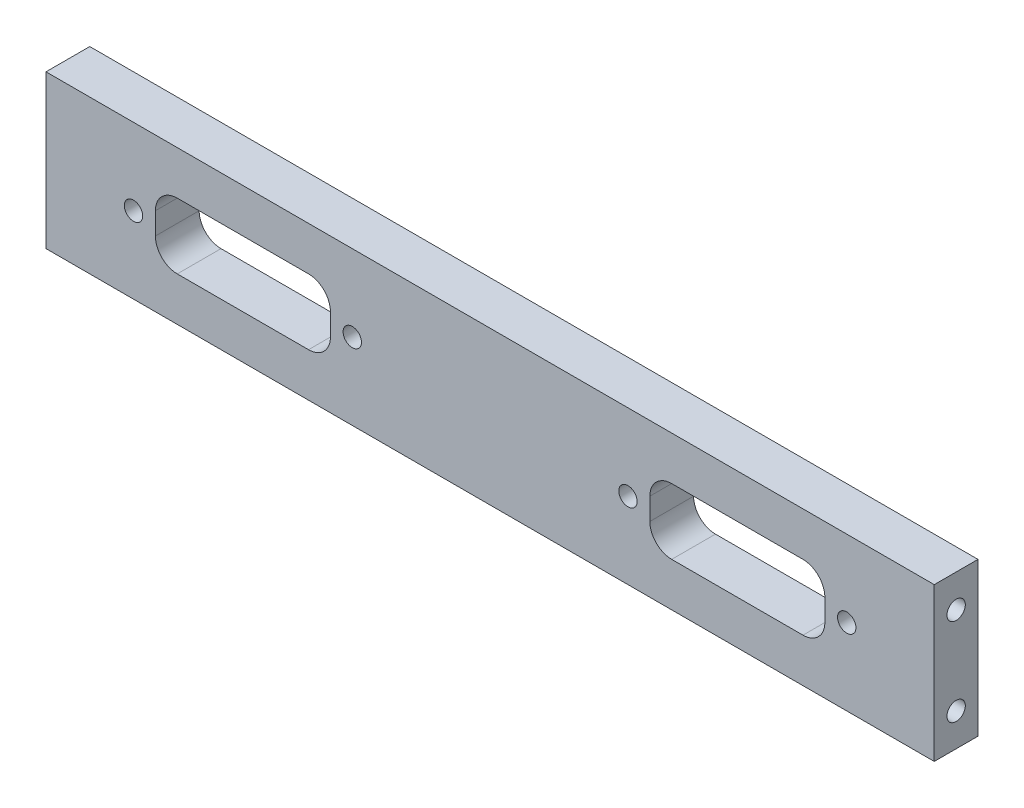
ISO-10303-21;
HEADER;
FILE_DESCRIPTION(('STEP AP214'),'2;1');
FILE_NAME('part.step','',(''),(''),'','','');
FILE_SCHEMA(('AUTOMOTIVE_DESIGN { 1 0 10303 214 1 1 1 1 }'));
ENDSEC;
DATA;
#1=APPLICATION_CONTEXT('core data for automotive mechanical design processes');
#2=APPLICATION_PROTOCOL_DEFINITION('international standard','automotive_design',2000,#1);
#3=PRODUCT_CONTEXT('',#1,'mechanical');
#4=PRODUCT('Part','Part','',(#3));
#5=PRODUCT_RELATED_PRODUCT_CATEGORY('part','',(#4));
#6=PRODUCT_DEFINITION_FORMATION('','',#4);
#7=PRODUCT_DEFINITION_CONTEXT('part definition',#1,'design');
#8=PRODUCT_DEFINITION('design','',#6,#7);
#9=PRODUCT_DEFINITION_SHAPE('','',#8);
#10=(LENGTH_UNIT() NAMED_UNIT(*) SI_UNIT(.MILLI.,.METRE.));
#11=(NAMED_UNIT(*) PLANE_ANGLE_UNIT() SI_UNIT($,.RADIAN.));
#12=(NAMED_UNIT(*) SI_UNIT($,.STERADIAN.) SOLID_ANGLE_UNIT());
#13=UNCERTAINTY_MEASURE_WITH_UNIT(LENGTH_MEASURE(1.E-05),#10,'distance_accuracy_value','');
#14=(GEOMETRIC_REPRESENTATION_CONTEXT(3) GLOBAL_UNCERTAINTY_ASSIGNED_CONTEXT((#13)) GLOBAL_UNIT_ASSIGNED_CONTEXT((#10,
#11,#12)) REPRESENTATION_CONTEXT('',''));
#15=CARTESIAN_POINT('',(0.,0.,0.));
#16=DIRECTION('',(0.,0.,1.));
#17=DIRECTION('',(1.,0.,0.));
#18=AXIS2_PLACEMENT_3D('',#15,#16,#17);
#19=CARTESIAN_POINT('',(0.,0.,5.));
#20=DIRECTION('',(0.,0.,-1.));
#21=DIRECTION('',(-1.,0.,0.));
#22=AXIS2_PLACEMENT_3D('',#19,#20,#21);
#23=PLANE('',#22);
#24=CARTESIAN_POINT('',(81.5000000000004,0.,5.00000000000001));
#25=DIRECTION('',(0.,0.,-1.));
#26=DIRECTION('',(-1.,0.,0.));
#27=AXIS2_PLACEMENT_3D('',#24,#25,#26);
#28=CIRCLE('',#27,2.09999999999998);
#29=CARTESIAN_POINT('',(79.4000000000004,0.,5.00000000000001));
#30=VERTEX_POINT('',#29);
#31=EDGE_CURVE('E511',#30,#30,#28,.T.);
#32=ORIENTED_EDGE('',*,*,#31,.T.);
#33=EDGE_LOOP('',(#32));
#34=FACE_BOUND('',#33,.T.);
#35=CARTESIAN_POINT('',(31.5000000000004,0.,5.00000000000001));
#36=DIRECTION('',(0.,0.,-1.));
#37=DIRECTION('',(-1.,0.,0.));
#38=AXIS2_PLACEMENT_3D('',#35,#36,#37);
#39=CIRCLE('',#38,2.09999999999997);
#40=CARTESIAN_POINT('',(29.4000000000004,0.,5.00000000000001));
#41=VERTEX_POINT('',#40);
#42=EDGE_CURVE('E351',#41,#41,#39,.T.);
#43=ORIENTED_EDGE('',*,*,#42,.T.);
#44=EDGE_LOOP('',(#43));
#45=FACE_BOUND('',#44,.T.);
#46=DIRECTION('',(0.,1.,0.));
#47=VECTOR('',#46,1.);
#48=CARTESIAN_POINT('',(-101.5,-17.5,5.));
#49=LINE('',#48,#47);
#50=CARTESIAN_POINT('',(-101.5,-17.5,5.));
#51=VERTEX_POINT('',#50);
#52=CARTESIAN_POINT('',(-101.5,17.5,5.));
#53=VERTEX_POINT('',#52);
#54=EDGE_CURVE('E222',#51,#53,#49,.T.);
#55=ORIENTED_EDGE('',*,*,#54,.F.);
#56=DIRECTION('',(1.,0.,0.));
#57=VECTOR('',#56,1.);
#58=CARTESIAN_POINT('',(-101.5,-17.5,5.));
#59=LINE('',#58,#57);
#60=CARTESIAN_POINT('',(101.5,-17.5,5.));
#61=VERTEX_POINT('',#60);
#62=EDGE_CURVE('E231',#51,#61,#59,.T.);
#63=ORIENTED_EDGE('',*,*,#62,.T.);
#64=DIRECTION('',(0.,1.,0.));
#65=VECTOR('',#64,1.);
#66=CARTESIAN_POINT('',(101.5,-17.5,5.));
#67=LINE('',#66,#65);
#68=CARTESIAN_POINT('',(101.5,17.5,5.));
#69=VERTEX_POINT('',#68);
#70=EDGE_CURVE('E229',#61,#69,#67,.T.);
#71=ORIENTED_EDGE('',*,*,#70,.T.);
#72=DIRECTION('',(1.,0.,0.));
#73=VECTOR('',#72,1.);
#74=CARTESIAN_POINT('',(-101.5,17.5,5.));
#75=LINE('',#74,#73);
#76=EDGE_CURVE('E225',#53,#69,#75,.T.);
#77=ORIENTED_EDGE('',*,*,#76,.F.);
#78=EDGE_LOOP('',(#55,#63,#71,#77));
#79=FACE_BOUND('',#78,.T.);
#80=DIRECTION('',(0.,-1.,0.));
#81=VECTOR('',#80,1.);
#82=CARTESIAN_POINT('',(-36.5000000000004,-7.5,5.));
#83=LINE('',#82,#81);
#84=CARTESIAN_POINT('',(-36.5000000000004,2.5,5.));
#85=VERTEX_POINT('',#84);
#86=CARTESIAN_POINT('',(-36.5000000000004,-2.5,5.));
#87=VERTEX_POINT('',#86);
#88=EDGE_CURVE('E372',#85,#87,#83,.T.);
#89=ORIENTED_EDGE('',*,*,#88,.T.);
#90=CARTESIAN_POINT('',(-41.5000000000004,-2.5,5.));
#91=DIRECTION('',(0.,0.,-1.));
#92=DIRECTION('',(-1.,0.,0.));
#93=AXIS2_PLACEMENT_3D('',#90,#91,#92);
#94=CIRCLE('',#93,5.);
#95=CARTESIAN_POINT('',(-41.5000000000004,-7.5,5.));
#96=VERTEX_POINT('',#95);
#97=EDGE_CURVE('E281',#87,#96,#94,.T.);
#98=ORIENTED_EDGE('',*,*,#97,.T.);
#99=DIRECTION('',(-1.,0.,0.));
#100=VECTOR('',#99,1.);
#101=CARTESIAN_POINT('',(-36.5000000000004,-7.5,5.));
#102=LINE('',#101,#100);
#103=CARTESIAN_POINT('',(-71.5000000000004,-7.5,5.));
#104=VERTEX_POINT('',#103);
#105=EDGE_CURVE('E203',#96,#104,#102,.T.);
#106=ORIENTED_EDGE('',*,*,#105,.T.);
#107=CARTESIAN_POINT('',(-71.5000000000004,-2.5,5.));
#108=DIRECTION('',(0.,0.,-1.));
#109=DIRECTION('',(-1.,0.,0.));
#110=AXIS2_PLACEMENT_3D('',#107,#108,#109);
#111=CIRCLE('',#110,5.);
#112=CARTESIAN_POINT('',(-76.5000000000004,-2.5,5.));
#113=VERTEX_POINT('',#112);
#114=EDGE_CURVE('E273',#104,#113,#111,.T.);
#115=ORIENTED_EDGE('',*,*,#114,.T.);
#116=DIRECTION('',(0.,1.,0.));
#117=VECTOR('',#116,1.);
#118=CARTESIAN_POINT('',(-76.5000000000004,-7.5,5.));
#119=LINE('',#118,#117);
#120=CARTESIAN_POINT('',(-76.5000000000004,2.5,5.));
#121=VERTEX_POINT('',#120);
#122=EDGE_CURVE('E365',#113,#121,#119,.T.);
#123=ORIENTED_EDGE('',*,*,#122,.T.);
#124=CARTESIAN_POINT('',(-71.5000000000004,2.5,5.));
#125=DIRECTION('',(0.,0.,-1.));
#126=DIRECTION('',(-1.,0.,0.));
#127=AXIS2_PLACEMENT_3D('',#124,#125,#126);
#128=CIRCLE('',#127,5.);
#129=CARTESIAN_POINT('',(-71.5000000000004,7.5,5.));
#130=VERTEX_POINT('',#129);
#131=EDGE_CURVE('E277',#121,#130,#128,.T.);
#132=ORIENTED_EDGE('',*,*,#131,.T.);
#133=DIRECTION('',(1.,0.,0.));
#134=VECTOR('',#133,1.);
#135=CARTESIAN_POINT('',(-36.5000000000004,7.5,5.));
#136=LINE('',#135,#134);
#137=CARTESIAN_POINT('',(-41.5000000000004,7.5,5.));
#138=VERTEX_POINT('',#137);
#139=EDGE_CURVE('E368',#130,#138,#136,.T.);
#140=ORIENTED_EDGE('',*,*,#139,.T.);
#141=CARTESIAN_POINT('',(-41.5000000000004,2.5,5.));
#142=DIRECTION('',(0.,0.,-1.));
#143=DIRECTION('',(-1.,0.,0.));
#144=AXIS2_PLACEMENT_3D('',#141,#142,#143);
#145=CIRCLE('',#144,5.);
#146=EDGE_CURVE('E285',#138,#85,#145,.T.);
#147=ORIENTED_EDGE('',*,*,#146,.T.);
#148=EDGE_LOOP('',(#89,#98,#106,#115,#123,#132,#140,#147));
#149=FACE_BOUND('',#148,.T.);
#150=CARTESIAN_POINT('',(-31.5000000000004,0.,5.00000000000001));
#151=DIRECTION('',(0.,0.,-1.));
#152=DIRECTION('',(-1.,0.,0.));
#153=AXIS2_PLACEMENT_3D('',#150,#151,#152);
#154=CIRCLE('',#153,2.09999999999997);
#155=CARTESIAN_POINT('',(-33.6000000000003,0.,5.00000000000001));
#156=VERTEX_POINT('',#155);
#157=EDGE_CURVE('E361',#156,#156,#154,.T.);
#158=ORIENTED_EDGE('',*,*,#157,.T.);
#159=EDGE_LOOP('',(#158));
#160=FACE_BOUND('',#159,.T.);
#161=CARTESIAN_POINT('',(-81.5000000000004,0.,5.00000000000001));
#162=DIRECTION('',(0.,0.,-1.));
#163=DIRECTION('',(-1.,0.,0.));
#164=AXIS2_PLACEMENT_3D('',#161,#162,#163);
#165=CIRCLE('',#164,2.09999999999998);
#166=CARTESIAN_POINT('',(-83.6000000000003,0.,5.00000000000001));
#167=VERTEX_POINT('',#166);
#168=EDGE_CURVE('E342',#167,#167,#165,.T.);
#169=ORIENTED_EDGE('',*,*,#168,.T.);
#170=EDGE_LOOP('',(#169));
#171=FACE_BOUND('',#170,.T.);
#172=DIRECTION('',(0.,1.,0.));
#173=VECTOR('',#172,1.);
#174=CARTESIAN_POINT('',(76.5000000000004,-7.5,5.));
#175=LINE('',#174,#173);
#176=CARTESIAN_POINT('',(76.5000000000004,-2.5,5.));
#177=VERTEX_POINT('',#176);
#178=CARTESIAN_POINT('',(76.5000000000004,2.5,5.));
#179=VERTEX_POINT('',#178);
#180=EDGE_CURVE('E354',#177,#179,#175,.T.);
#181=ORIENTED_EDGE('',*,*,#180,.F.);
#182=CARTESIAN_POINT('',(71.5000000000004,-2.5,5.));
#183=DIRECTION('',(0.,0.,-1.));
#184=DIRECTION('',(-1.,0.,0.));
#185=AXIS2_PLACEMENT_3D('',#182,#183,#184);
#186=CIRCLE('',#185,5.);
#187=CARTESIAN_POINT('',(71.5000000000004,-7.5,5.));
#188=VERTEX_POINT('',#187);
#189=EDGE_CURVE('E308',#177,#188,#186,.T.);
#190=ORIENTED_EDGE('',*,*,#189,.T.);
#191=DIRECTION('',(1.,0.,0.));
#192=VECTOR('',#191,1.);
#193=CARTESIAN_POINT('',(36.5000000000004,-7.5,5.));
#194=LINE('',#193,#192);
#195=CARTESIAN_POINT('',(41.5000000000004,-7.5,5.));
#196=VERTEX_POINT('',#195);
#197=EDGE_CURVE('E344',#196,#188,#194,.T.);
#198=ORIENTED_EDGE('',*,*,#197,.F.);
#199=CARTESIAN_POINT('',(41.5000000000004,-2.5,5.));
#200=DIRECTION('',(0.,0.,-1.));
#201=DIRECTION('',(-1.,0.,0.));
#202=AXIS2_PLACEMENT_3D('',#199,#200,#201);
#203=CIRCLE('',#202,5.);
#204=CARTESIAN_POINT('',(36.5000000000004,-2.5,5.));
#205=VERTEX_POINT('',#204);
#206=EDGE_CURVE('E53',#196,#205,#203,.T.);
#207=ORIENTED_EDGE('',*,*,#206,.T.);
#208=DIRECTION('',(0.,-1.,0.));
#209=VECTOR('',#208,1.);
#210=CARTESIAN_POINT('',(36.5000000000004,-7.5,5.));
#211=LINE('',#210,#209);
#212=CARTESIAN_POINT('',(36.5000000000004,2.5,5.));
#213=VERTEX_POINT('',#212);
#214=EDGE_CURVE('E335',#213,#205,#211,.T.);
#215=ORIENTED_EDGE('',*,*,#214,.F.);
#216=CARTESIAN_POINT('',(41.5000000000004,2.5,5.));
#217=DIRECTION('',(0.,0.,-1.));
#218=DIRECTION('',(-1.,0.,0.));
#219=AXIS2_PLACEMENT_3D('',#216,#217,#218);
#220=CIRCLE('',#219,5.);
#221=CARTESIAN_POINT('',(41.5000000000004,7.5,5.));
#222=VERTEX_POINT('',#221);
#223=EDGE_CURVE('E11',#213,#222,#220,.T.);
#224=ORIENTED_EDGE('',*,*,#223,.T.);
#225=DIRECTION('',(-1.,0.,0.));
#226=VECTOR('',#225,1.);
#227=CARTESIAN_POINT('',(36.5000000000004,7.5,5.));
#228=LINE('',#227,#226);
#229=CARTESIAN_POINT('',(71.5000000000004,7.5,5.));
#230=VERTEX_POINT('',#229);
#231=EDGE_CURVE('E333',#230,#222,#228,.T.);
#232=ORIENTED_EDGE('',*,*,#231,.F.);
#233=CARTESIAN_POINT('',(71.5000000000004,2.5,5.));
#234=DIRECTION('',(0.,0.,-1.));
#235=DIRECTION('',(-1.,0.,0.));
#236=AXIS2_PLACEMENT_3D('',#233,#234,#235);
#237=CIRCLE('',#236,5.);
#238=EDGE_CURVE('E312',#230,#179,#237,.T.);
#239=ORIENTED_EDGE('',*,*,#238,.T.);
#240=EDGE_LOOP('',(#181,#190,#198,#207,#215,#224,#232,#239));
#241=FACE_BOUND('',#240,.T.);
#242=ADVANCED_FACE('F38',(#34,#45,#79,#149,#160,#171,#241),#23,.F.);
#243=CARTESIAN_POINT('',(0.,0.,-5.));
#244=DIRECTION('',(0.,0.,-1.));
#245=DIRECTION('',(-1.,0.,0.));
#246=AXIS2_PLACEMENT_3D('',#243,#244,#245);
#247=PLANE('',#246);
#248=CARTESIAN_POINT('',(81.5000000000004,0.,-5.));
#249=DIRECTION('',(0.,0.,-1.));
#250=DIRECTION('',(-1.,0.,0.));
#251=AXIS2_PLACEMENT_3D('',#248,#249,#250);
#252=CIRCLE('',#251,2.09999999999999);
#253=CARTESIAN_POINT('',(79.4000000000004,0.,-5.));
#254=VERTEX_POINT('',#253);
#255=EDGE_CURVE('E513',#254,#254,#252,.T.);
#256=ORIENTED_EDGE('',*,*,#255,.F.);
#257=EDGE_LOOP('',(#256));
#258=FACE_BOUND('',#257,.T.);
#259=CARTESIAN_POINT('',(31.5000000000004,0.,-5.));
#260=DIRECTION('',(0.,0.,-1.));
#261=DIRECTION('',(-1.,0.,0.));
#262=AXIS2_PLACEMENT_3D('',#259,#260,#261);
#263=CIRCLE('',#262,2.09999999999999);
#264=CARTESIAN_POINT('',(29.4000000000004,0.,-5.));
#265=VERTEX_POINT('',#264);
#266=EDGE_CURVE('E508',#265,#265,#263,.T.);
#267=ORIENTED_EDGE('',*,*,#266,.F.);
#268=EDGE_LOOP('',(#267));
#269=FACE_BOUND('',#268,.T.);
#270=CARTESIAN_POINT('',(-81.5000000000004,0.,-5.));
#271=DIRECTION('',(0.,0.,-1.));
#272=DIRECTION('',(-1.,0.,0.));
#273=AXIS2_PLACEMENT_3D('',#270,#271,#272);
#274=CIRCLE('',#273,2.09999999999999);
#275=CARTESIAN_POINT('',(-83.6000000000003,0.,-5.));
#276=VERTEX_POINT('',#275);
#277=EDGE_CURVE('E339',#276,#276,#274,.T.);
#278=ORIENTED_EDGE('',*,*,#277,.F.);
#279=EDGE_LOOP('',(#278));
#280=FACE_BOUND('',#279,.T.);
#281=CARTESIAN_POINT('',(-31.5000000000004,0.,-5.));
#282=DIRECTION('',(0.,0.,-1.));
#283=DIRECTION('',(-1.,0.,0.));
#284=AXIS2_PLACEMENT_3D('',#281,#282,#283);
#285=CIRCLE('',#284,2.09999999999999);
#286=CARTESIAN_POINT('',(-33.6000000000003,0.,-5.));
#287=VERTEX_POINT('',#286);
#288=EDGE_CURVE('E358',#287,#287,#285,.T.);
#289=ORIENTED_EDGE('',*,*,#288,.F.);
#290=EDGE_LOOP('',(#289));
#291=FACE_BOUND('',#290,.T.);
#292=DIRECTION('',(0.,1.,0.));
#293=VECTOR('',#292,1.);
#294=CARTESIAN_POINT('',(-76.5000000000004,-7.5,-5.));
#295=LINE('',#294,#293);
#296=CARTESIAN_POINT('',(-76.5000000000004,-2.5,-5.));
#297=VERTEX_POINT('',#296);
#298=CARTESIAN_POINT('',(-76.5000000000004,2.5,-5.));
#299=VERTEX_POINT('',#298);
#300=EDGE_CURVE('E364',#297,#299,#295,.T.);
#301=ORIENTED_EDGE('',*,*,#300,.F.);
#302=CARTESIAN_POINT('',(-71.5000000000004,-2.5,-5.));
#303=DIRECTION('',(0.,0.,-1.));
#304=DIRECTION('',(-1.,0.,0.));
#305=AXIS2_PLACEMENT_3D('',#302,#303,#304);
#306=CIRCLE('',#305,5.);
#307=CARTESIAN_POINT('',(-71.5000000000004,-7.5,-5.));
#308=VERTEX_POINT('',#307);
#309=EDGE_CURVE('E271',#297,#308,#306,.F.);
#310=ORIENTED_EDGE('',*,*,#309,.T.);
#311=DIRECTION('',(-1.,0.,0.));
#312=VECTOR('',#311,1.);
#313=CARTESIAN_POINT('',(-36.5000000000004,-7.5,-5.));
#314=LINE('',#313,#312);
#315=CARTESIAN_POINT('',(-41.5000000000004,-7.5,-5.));
#316=VERTEX_POINT('',#315);
#317=EDGE_CURVE('E369',#316,#308,#314,.T.);
#318=ORIENTED_EDGE('',*,*,#317,.F.);
#319=CARTESIAN_POINT('',(-41.5000000000004,-2.5,-5.));
#320=DIRECTION('',(0.,0.,-1.));
#321=DIRECTION('',(-1.,0.,0.));
#322=AXIS2_PLACEMENT_3D('',#319,#320,#321);
#323=CIRCLE('',#322,5.);
#324=CARTESIAN_POINT('',(-36.5000000000004,-2.5,-5.));
#325=VERTEX_POINT('',#324);
#326=EDGE_CURVE('E279',#316,#325,#323,.F.);
#327=ORIENTED_EDGE('',*,*,#326,.T.);
#328=DIRECTION('',(0.,-1.,0.));
#329=VECTOR('',#328,1.);
#330=CARTESIAN_POINT('',(-36.5000000000004,-7.5,-5.));
#331=LINE('',#330,#329);
#332=CARTESIAN_POINT('',(-36.5000000000004,2.5,-5.));
#333=VERTEX_POINT('',#332);
#334=EDGE_CURVE('E382',#333,#325,#331,.T.);
#335=ORIENTED_EDGE('',*,*,#334,.F.);
#336=CARTESIAN_POINT('',(-41.5000000000004,2.5,-5.));
#337=DIRECTION('',(0.,0.,-1.));
#338=DIRECTION('',(-1.,0.,0.));
#339=AXIS2_PLACEMENT_3D('',#336,#337,#338);
#340=CIRCLE('',#339,5.);
#341=CARTESIAN_POINT('',(-41.5000000000004,7.5,-5.));
#342=VERTEX_POINT('',#341);
#343=EDGE_CURVE('E283',#333,#342,#340,.F.);
#344=ORIENTED_EDGE('',*,*,#343,.T.);
#345=DIRECTION('',(1.,0.,0.));
#346=VECTOR('',#345,1.);
#347=CARTESIAN_POINT('',(-36.5000000000004,7.5,-5.));
#348=LINE('',#347,#346);
#349=CARTESIAN_POINT('',(-71.5000000000004,7.5,-5.));
#350=VERTEX_POINT('',#349);
#351=EDGE_CURVE('E379',#350,#342,#348,.T.);
#352=ORIENTED_EDGE('',*,*,#351,.F.);
#353=CARTESIAN_POINT('',(-71.5000000000004,2.5,-5.));
#354=DIRECTION('',(0.,0.,-1.));
#355=DIRECTION('',(-1.,0.,0.));
#356=AXIS2_PLACEMENT_3D('',#353,#354,#355);
#357=CIRCLE('',#356,5.);
#358=EDGE_CURVE('E275',#350,#299,#357,.F.);
#359=ORIENTED_EDGE('',*,*,#358,.T.);
#360=EDGE_LOOP('',(#301,#310,#318,#327,#335,#344,#352,#359));
#361=FACE_BOUND('',#360,.T.);
#362=DIRECTION('',(0.,1.,0.));
#363=VECTOR('',#362,1.);
#364=CARTESIAN_POINT('',(-101.5,-17.5,-5.));
#365=LINE('',#364,#363);
#366=CARTESIAN_POINT('',(-101.5,-17.5,-5.));
#367=VERTEX_POINT('',#366);
#368=CARTESIAN_POINT('',(-101.5,17.5,-5.));
#369=VERTEX_POINT('',#368);
#370=EDGE_CURVE('E221',#367,#369,#365,.T.);
#371=ORIENTED_EDGE('',*,*,#370,.T.);
#372=DIRECTION('',(1.,0.,0.));
#373=VECTOR('',#372,1.);
#374=CARTESIAN_POINT('',(-101.5,17.5,-5.));
#375=LINE('',#374,#373);
#376=CARTESIAN_POINT('',(101.5,17.5,-5.));
#377=VERTEX_POINT('',#376);
#378=EDGE_CURVE('E236',#369,#377,#375,.T.);
#379=ORIENTED_EDGE('',*,*,#378,.T.);
#380=DIRECTION('',(0.,1.,0.));
#381=VECTOR('',#380,1.);
#382=CARTESIAN_POINT('',(101.5,-17.5,-5.));
#383=LINE('',#382,#381);
#384=CARTESIAN_POINT('',(101.5,-17.5,-5.));
#385=VERTEX_POINT('',#384);
#386=EDGE_CURVE('E239',#385,#377,#383,.T.);
#387=ORIENTED_EDGE('',*,*,#386,.F.);
#388=DIRECTION('',(1.,0.,0.));
#389=VECTOR('',#388,1.);
#390=CARTESIAN_POINT('',(-101.5,-17.5,-5.));
#391=LINE('',#390,#389);
#392=EDGE_CURVE('E226',#367,#385,#391,.T.);
#393=ORIENTED_EDGE('',*,*,#392,.F.);
#394=EDGE_LOOP('',(#371,#379,#387,#393));
#395=FACE_BOUND('',#394,.T.);
#396=DIRECTION('',(0.,-1.,0.));
#397=VECTOR('',#396,1.);
#398=CARTESIAN_POINT('',(36.5000000000004,-7.5,-5.));
#399=LINE('',#398,#397);
#400=CARTESIAN_POINT('',(36.5000000000004,2.5,-5.));
#401=VERTEX_POINT('',#400);
#402=CARTESIAN_POINT('',(36.5000000000004,-2.5,-5.));
#403=VERTEX_POINT('',#402);
#404=EDGE_CURVE('E320',#401,#403,#399,.T.);
#405=ORIENTED_EDGE('',*,*,#404,.T.);
#406=CARTESIAN_POINT('',(41.5000000000004,-2.5,-5.));
#407=DIRECTION('',(0.,0.,-1.));
#408=DIRECTION('',(-1.,0.,0.));
#409=AXIS2_PLACEMENT_3D('',#406,#407,#408);
#410=CIRCLE('',#409,5.);
#411=CARTESIAN_POINT('',(41.5000000000004,-7.5,-5.));
#412=VERTEX_POINT('',#411);
#413=EDGE_CURVE('E314',#403,#412,#410,.F.);
#414=ORIENTED_EDGE('',*,*,#413,.T.);
#415=DIRECTION('',(1.,0.,0.));
#416=VECTOR('',#415,1.);
#417=CARTESIAN_POINT('',(36.5000000000004,-7.5,-5.));
#418=LINE('',#417,#416);
#419=CARTESIAN_POINT('',(71.5000000000004,-7.5,-5.));
#420=VERTEX_POINT('',#419);
#421=EDGE_CURVE('E327',#412,#420,#418,.T.);
#422=ORIENTED_EDGE('',*,*,#421,.T.);
#423=CARTESIAN_POINT('',(71.5000000000004,-2.5,-5.));
#424=DIRECTION('',(0.,0.,-1.));
#425=DIRECTION('',(-1.,0.,0.));
#426=AXIS2_PLACEMENT_3D('',#423,#424,#425);
#427=CIRCLE('',#426,5.);
#428=CARTESIAN_POINT('',(76.5000000000004,-2.5,-5.));
#429=VERTEX_POINT('',#428);
#430=EDGE_CURVE('E306',#420,#429,#427,.F.);
#431=ORIENTED_EDGE('',*,*,#430,.T.);
#432=DIRECTION('',(0.,1.,0.));
#433=VECTOR('',#432,1.);
#434=CARTESIAN_POINT('',(76.5000000000004,-7.5,-5.));
#435=LINE('',#434,#433);
#436=CARTESIAN_POINT('',(76.5000000000004,2.5,-5.));
#437=VERTEX_POINT('',#436);
#438=EDGE_CURVE('E348',#429,#437,#435,.T.);
#439=ORIENTED_EDGE('',*,*,#438,.T.);
#440=CARTESIAN_POINT('',(71.5000000000004,2.5,-5.));
#441=DIRECTION('',(0.,0.,-1.));
#442=DIRECTION('',(-1.,0.,0.));
#443=AXIS2_PLACEMENT_3D('',#440,#441,#442);
#444=CIRCLE('',#443,5.);
#445=CARTESIAN_POINT('',(71.5000000000004,7.5,-5.));
#446=VERTEX_POINT('',#445);
#447=EDGE_CURVE('E310',#437,#446,#444,.F.);
#448=ORIENTED_EDGE('',*,*,#447,.T.);
#449=DIRECTION('',(-1.,0.,0.));
#450=VECTOR('',#449,1.);
#451=CARTESIAN_POINT('',(36.5000000000004,7.5,-5.));
#452=LINE('',#451,#450);
#453=CARTESIAN_POINT('',(41.5000000000004,7.5,-5.));
#454=VERTEX_POINT('',#453);
#455=EDGE_CURVE('E322',#446,#454,#452,.T.);
#456=ORIENTED_EDGE('',*,*,#455,.T.);
#457=CARTESIAN_POINT('',(41.5000000000004,2.5,-5.));
#458=DIRECTION('',(0.,0.,-1.));
#459=DIRECTION('',(-1.,0.,0.));
#460=AXIS2_PLACEMENT_3D('',#457,#458,#459);
#461=CIRCLE('',#460,5.);
#462=EDGE_CURVE('E46',#454,#401,#461,.F.);
#463=ORIENTED_EDGE('',*,*,#462,.T.);
#464=EDGE_LOOP('',(#405,#414,#422,#431,#439,#448,#456,#463));
#465=FACE_BOUND('',#464,.T.);
#466=ADVANCED_FACE('F319',(#258,#269,#280,#291,#361,#395,#465),#247,.T.);
#467=CARTESIAN_POINT('',(-101.5,-17.5,5.));
#468=DIRECTION('',(-1.,0.,0.));
#469=DIRECTION('',(0.,0.,1.));
#470=AXIS2_PLACEMENT_3D('',#467,#468,#469);
#471=PLANE('',#470);
#472=CARTESIAN_POINT('',(-101.5,10.,0.));
#473=DIRECTION('',(-1.,0.,0.));
#474=DIRECTION('',(0.,0.,1.));
#475=AXIS2_PLACEMENT_3D('',#472,#473,#474);
#476=CIRCLE('',#475,2.09999999999999);
#477=CARTESIAN_POINT('',(-101.5,10.,2.09999999999999));
#478=VERTEX_POINT('',#477);
#479=EDGE_CURVE('E209',#478,#478,#476,.T.);
#480=ORIENTED_EDGE('',*,*,#479,.F.);
#481=EDGE_LOOP('',(#480));
#482=FACE_BOUND('',#481,.T.);
#483=CARTESIAN_POINT('',(-101.5,-10.,0.));
#484=DIRECTION('',(-1.,0.,0.));
#485=DIRECTION('',(0.,0.,1.));
#486=AXIS2_PLACEMENT_3D('',#483,#484,#485);
#487=CIRCLE('',#486,2.09999999999999);
#488=CARTESIAN_POINT('',(-101.5,-10.,2.09999999999999));
#489=VERTEX_POINT('',#488);
#490=EDGE_CURVE('E215',#489,#489,#487,.T.);
#491=ORIENTED_EDGE('',*,*,#490,.F.);
#492=EDGE_LOOP('',(#491));
#493=FACE_BOUND('',#492,.T.);
#494=ORIENTED_EDGE('',*,*,#370,.F.);
#495=DIRECTION('',(0.,0.,-1.));
#496=VECTOR('',#495,1.);
#497=CARTESIAN_POINT('',(-101.5,-17.5,5.));
#498=LINE('',#497,#496);
#499=EDGE_CURVE('E243',#51,#367,#498,.T.);
#500=ORIENTED_EDGE('',*,*,#499,.F.);
#501=ORIENTED_EDGE('',*,*,#54,.T.);
#502=DIRECTION('',(0.,0.,-1.));
#503=VECTOR('',#502,1.);
#504=CARTESIAN_POINT('',(-101.5,17.5,5.));
#505=LINE('',#504,#503);
#506=EDGE_CURVE('E233',#53,#369,#505,.T.);
#507=ORIENTED_EDGE('',*,*,#506,.T.);
#508=EDGE_LOOP('',(#494,#500,#501,#507));
#509=FACE_BOUND('',#508,.T.);
#510=ADVANCED_FACE('F426',(#482,#493,#509),#471,.T.);
#511=CARTESIAN_POINT('',(-101.5,-17.5,5.));
#512=DIRECTION('',(0.,1.,0.));
#513=DIRECTION('',(0.,0.,1.));
#514=AXIS2_PLACEMENT_3D('',#511,#512,#513);
#515=PLANE('',#514);
#516=ORIENTED_EDGE('',*,*,#392,.T.);
#517=DIRECTION('',(0.,0.,-1.));
#518=VECTOR('',#517,1.);
#519=CARTESIAN_POINT('',(101.5,-17.5,5.));
#520=LINE('',#519,#518);
#521=EDGE_CURVE('E246',#61,#385,#520,.T.);
#522=ORIENTED_EDGE('',*,*,#521,.F.);
#523=ORIENTED_EDGE('',*,*,#62,.F.);
#524=ORIENTED_EDGE('',*,*,#499,.T.);
#525=EDGE_LOOP('',(#516,#522,#523,#524));
#526=FACE_BOUND('',#525,.T.);
#527=ADVANCED_FACE('F445',(#526),#515,.F.);
#528=CARTESIAN_POINT('',(101.5,-17.5,5.));
#529=DIRECTION('',(-1.,0.,0.));
#530=DIRECTION('',(0.,0.,1.));
#531=AXIS2_PLACEMENT_3D('',#528,#529,#530);
#532=PLANE('',#531);
#533=CARTESIAN_POINT('',(101.5,10.,0.));
#534=DIRECTION('',(1.,0.,0.));
#535=DIRECTION('',(0.,0.,-1.));
#536=AXIS2_PLACEMENT_3D('',#533,#534,#535);
#537=CIRCLE('',#536,2.09999999999999);
#538=CARTESIAN_POINT('',(101.5,10.,-2.09999999999999));
#539=VERTEX_POINT('',#538);
#540=EDGE_CURVE('E197',#539,#539,#537,.T.);
#541=ORIENTED_EDGE('',*,*,#540,.F.);
#542=EDGE_LOOP('',(#541));
#543=FACE_BOUND('',#542,.T.);
#544=CARTESIAN_POINT('',(101.5,-10.,0.));
#545=DIRECTION('',(1.,0.,0.));
#546=DIRECTION('',(0.,0.,-1.));
#547=AXIS2_PLACEMENT_3D('',#544,#545,#546);
#548=CIRCLE('',#547,2.09999999999999);
#549=CARTESIAN_POINT('',(101.5,-10.,-2.09999999999999));
#550=VERTEX_POINT('',#549);
#551=EDGE_CURVE('E196',#550,#550,#548,.T.);
#552=ORIENTED_EDGE('',*,*,#551,.F.);
#553=EDGE_LOOP('',(#552));
#554=FACE_BOUND('',#553,.T.);
#555=ORIENTED_EDGE('',*,*,#386,.T.);
#556=DIRECTION('',(0.,0.,-1.));
#557=VECTOR('',#556,1.);
#558=CARTESIAN_POINT('',(101.5,17.5,5.));
#559=LINE('',#558,#557);
#560=EDGE_CURVE('E249',#69,#377,#559,.T.);
#561=ORIENTED_EDGE('',*,*,#560,.F.);
#562=ORIENTED_EDGE('',*,*,#70,.F.);
#563=ORIENTED_EDGE('',*,*,#521,.T.);
#564=EDGE_LOOP('',(#555,#561,#562,#563));
#565=FACE_BOUND('',#564,.T.);
#566=ADVANCED_FACE('F442',(#543,#554,#565),#532,.F.);
#567=CARTESIAN_POINT('',(-101.5,17.5,5.));
#568=DIRECTION('',(0.,1.,0.));
#569=DIRECTION('',(0.,0.,1.));
#570=AXIS2_PLACEMENT_3D('',#567,#568,#569);
#571=PLANE('',#570);
#572=ORIENTED_EDGE('',*,*,#378,.F.);
#573=ORIENTED_EDGE('',*,*,#506,.F.);
#574=ORIENTED_EDGE('',*,*,#76,.T.);
#575=ORIENTED_EDGE('',*,*,#560,.T.);
#576=EDGE_LOOP('',(#572,#573,#574,#575));
#577=FACE_BOUND('',#576,.T.);
#578=ADVANCED_FACE('F438',(#577),#571,.T.);
#579=CARTESIAN_POINT('',(-87.5000000000004,-10.,0.));
#580=DIRECTION('',(-1.,0.,0.));
#581=DIRECTION('',(0.,0.,1.));
#582=AXIS2_PLACEMENT_3D('',#579,#580,#581);
#583=CONICAL_SURFACE('',#582,2.09999999999999,1.02974425867665);
#584=CARTESIAN_POINT('',(-86.2381927000425,-10.,0.));
#585=VERTEX_POINT('',#584);
#586=VERTEX_LOOP('',#585);
#587=FACE_BOUND('',#586,.T.);
#588=CARTESIAN_POINT('',(-87.5000000000004,-10.,0.));
#589=DIRECTION('',(-1.,0.,0.));
#590=DIRECTION('',(0.,0.,1.));
#591=AXIS2_PLACEMENT_3D('',#588,#589,#590);
#592=CIRCLE('',#591,2.09999999999999);
#593=CARTESIAN_POINT('',(-87.5000000000004,-10.,2.09999999999999));
#594=VERTEX_POINT('',#593);
#595=EDGE_CURVE('E218',#594,#594,#592,.T.);
#596=ORIENTED_EDGE('',*,*,#595,.T.);
#597=EDGE_LOOP('',(#596));
#598=FACE_BOUND('',#597,.T.);
#599=ADVANCED_FACE('F455',(#587,#598),#583,.F.);
#600=CARTESIAN_POINT('',(-101.5,-10.,0.));
#601=DIRECTION('',(-1.,0.,0.));
#602=DIRECTION('',(0.,0.,1.));
#603=AXIS2_PLACEMENT_3D('',#600,#601,#602);
#604=CYLINDRICAL_SURFACE('',#603,2.09999999999999);
#605=ORIENTED_EDGE('',*,*,#595,.F.);
#606=EDGE_LOOP('',(#605));
#607=FACE_BOUND('',#606,.T.);
#608=ORIENTED_EDGE('',*,*,#490,.T.);
#609=EDGE_LOOP('',(#608));
#610=FACE_BOUND('',#609,.T.);
#611=ADVANCED_FACE('F560',(#607,#610),#604,.F.);
#612=CARTESIAN_POINT('',(-87.5000000000004,10.,0.));
#613=DIRECTION('',(-1.,0.,0.));
#614=DIRECTION('',(0.,0.,1.));
#615=AXIS2_PLACEMENT_3D('',#612,#613,#614);
#616=CONICAL_SURFACE('',#615,2.09999999999999,1.02974425867665);
#617=CARTESIAN_POINT('',(-86.2381927000425,10.,0.));
#618=VERTEX_POINT('',#617);
#619=VERTEX_LOOP('',#618);
#620=FACE_BOUND('',#619,.T.);
#621=CARTESIAN_POINT('',(-87.5000000000004,10.,0.));
#622=DIRECTION('',(-1.,0.,0.));
#623=DIRECTION('',(0.,0.,1.));
#624=AXIS2_PLACEMENT_3D('',#621,#622,#623);
#625=CIRCLE('',#624,2.09999999999999);
#626=CARTESIAN_POINT('',(-87.5000000000004,10.,2.09999999999999));
#627=VERTEX_POINT('',#626);
#628=EDGE_CURVE('E212',#627,#627,#625,.T.);
#629=ORIENTED_EDGE('',*,*,#628,.T.);
#630=EDGE_LOOP('',(#629));
#631=FACE_BOUND('',#630,.T.);
#632=ADVANCED_FACE('F557',(#620,#631),#616,.F.);
#633=CARTESIAN_POINT('',(-101.5,10.,0.));
#634=DIRECTION('',(-1.,0.,0.));
#635=DIRECTION('',(0.,0.,1.));
#636=AXIS2_PLACEMENT_3D('',#633,#634,#635);
#637=CYLINDRICAL_SURFACE('',#636,2.09999999999999);
#638=ORIENTED_EDGE('',*,*,#628,.F.);
#639=EDGE_LOOP('',(#638));
#640=FACE_BOUND('',#639,.T.);
#641=ORIENTED_EDGE('',*,*,#479,.T.);
#642=EDGE_LOOP('',(#641));
#643=FACE_BOUND('',#642,.T.);
#644=ADVANCED_FACE('F553',(#640,#643),#637,.F.);
#645=CARTESIAN_POINT('',(87.5000000000004,-10.,0.));
#646=DIRECTION('',(1.,0.,0.));
#647=DIRECTION('',(0.,0.,-1.));
#648=AXIS2_PLACEMENT_3D('',#645,#646,#647);
#649=CONICAL_SURFACE('',#648,2.09999999999999,1.02974425867665);
#650=CARTESIAN_POINT('',(86.2381927000425,-10.,0.));
#651=VERTEX_POINT('',#650);
#652=VERTEX_LOOP('',#651);
#653=FACE_BOUND('',#652,.T.);
#654=CARTESIAN_POINT('',(87.5000000000004,-10.,0.));
#655=DIRECTION('',(1.,0.,0.));
#656=DIRECTION('',(0.,0.,-1.));
#657=AXIS2_PLACEMENT_3D('',#654,#655,#656);
#658=CIRCLE('',#657,2.09999999999999);
#659=CARTESIAN_POINT('',(87.5000000000004,-10.,-2.09999999999999));
#660=VERTEX_POINT('',#659);
#661=EDGE_CURVE('E200',#660,#660,#658,.T.);
#662=ORIENTED_EDGE('',*,*,#661,.T.);
#663=EDGE_LOOP('',(#662));
#664=FACE_BOUND('',#663,.T.);
#665=ADVANCED_FACE('F549',(#653,#664),#649,.F.);
#666=CARTESIAN_POINT('',(101.5,-10.,0.));
#667=DIRECTION('',(1.,0.,0.));
#668=DIRECTION('',(0.,0.,-1.));
#669=AXIS2_PLACEMENT_3D('',#666,#667,#668);
#670=CYLINDRICAL_SURFACE('',#669,2.09999999999999);
#671=ORIENTED_EDGE('',*,*,#661,.F.);
#672=EDGE_LOOP('',(#671));
#673=FACE_BOUND('',#672,.T.);
#674=ORIENTED_EDGE('',*,*,#551,.T.);
#675=EDGE_LOOP('',(#674));
#676=FACE_BOUND('',#675,.T.);
#677=ADVANCED_FACE('F190',(#673,#676),#670,.F.);
#678=CARTESIAN_POINT('',(87.5000000000004,10.,0.));
#679=DIRECTION('',(1.,0.,0.));
#680=DIRECTION('',(0.,0.,-1.));
#681=AXIS2_PLACEMENT_3D('',#678,#679,#680);
#682=CONICAL_SURFACE('',#681,2.09999999999999,1.02974425867665);
#683=CARTESIAN_POINT('',(86.2381927000425,10.,0.));
#684=VERTEX_POINT('',#683);
#685=VERTEX_LOOP('',#684);
#686=FACE_BOUND('',#685,.T.);
#687=CARTESIAN_POINT('',(87.5000000000004,10.,0.));
#688=DIRECTION('',(1.,0.,0.));
#689=DIRECTION('',(0.,0.,-1.));
#690=AXIS2_PLACEMENT_3D('',#687,#688,#689);
#691=CIRCLE('',#690,2.09999999999999);
#692=CARTESIAN_POINT('',(87.5000000000004,10.,-2.09999999999999));
#693=VERTEX_POINT('',#692);
#694=EDGE_CURVE('E194',#693,#693,#691,.T.);
#695=ORIENTED_EDGE('',*,*,#694,.T.);
#696=EDGE_LOOP('',(#695));
#697=FACE_BOUND('',#696,.T.);
#698=ADVANCED_FACE('F186',(#686,#697),#682,.F.);
#699=CARTESIAN_POINT('',(101.5,10.,0.));
#700=DIRECTION('',(1.,0.,0.));
#701=DIRECTION('',(0.,0.,-1.));
#702=AXIS2_PLACEMENT_3D('',#699,#700,#701);
#703=CYLINDRICAL_SURFACE('',#702,2.09999999999999);
#704=ORIENTED_EDGE('',*,*,#694,.F.);
#705=EDGE_LOOP('',(#704));
#706=FACE_BOUND('',#705,.T.);
#707=ORIENTED_EDGE('',*,*,#540,.T.);
#708=EDGE_LOOP('',(#707));
#709=FACE_BOUND('',#708,.T.);
#710=ADVANCED_FACE('F189',(#706,#709),#703,.F.);
#711=CARTESIAN_POINT('',(-76.5000000000004,-7.5,5.));
#712=DIRECTION('',(-1.,0.,0.));
#713=DIRECTION('',(0.,0.,1.));
#714=AXIS2_PLACEMENT_3D('',#711,#712,#713);
#715=PLANE('',#714);
#716=ORIENTED_EDGE('',*,*,#122,.F.);
#717=DIRECTION('',(0.,0.,-1.));
#718=VECTOR('',#717,1.);
#719=CARTESIAN_POINT('',(-76.5000000000004,-2.5,-5.));
#720=LINE('',#719,#718);
#721=EDGE_CURVE('E253',#113,#297,#720,.T.);
#722=ORIENTED_EDGE('',*,*,#721,.T.);
#723=ORIENTED_EDGE('',*,*,#300,.T.);
#724=DIRECTION('',(0.,0.,-1.));
#725=VECTOR('',#724,1.);
#726=CARTESIAN_POINT('',(-76.5000000000004,2.5,5.));
#727=LINE('',#726,#725);
#728=EDGE_CURVE('E245',#299,#121,#727,.F.);
#729=ORIENTED_EDGE('',*,*,#728,.T.);
#730=EDGE_LOOP('',(#716,#722,#723,#729));
#731=FACE_BOUND('',#730,.T.);
#732=ADVANCED_FACE('F401',(#731),#715,.F.);
#733=CARTESIAN_POINT('',(-36.5000000000004,-7.5,5.));
#734=DIRECTION('',(0.,-1.,0.));
#735=DIRECTION('',(0.,0.,-1.));
#736=AXIS2_PLACEMENT_3D('',#733,#734,#735);
#737=PLANE('',#736);
#738=ORIENTED_EDGE('',*,*,#317,.T.);
#739=DIRECTION('',(0.,0.,-1.));
#740=VECTOR('',#739,1.);
#741=CARTESIAN_POINT('',(-71.5000000000004,-7.5,5.));
#742=LINE('',#741,#740);
#743=EDGE_CURVE('E259',#308,#104,#742,.F.);
#744=ORIENTED_EDGE('',*,*,#743,.T.);
#745=ORIENTED_EDGE('',*,*,#105,.F.);
#746=DIRECTION('',(0.,0.,-1.));
#747=VECTOR('',#746,1.);
#748=CARTESIAN_POINT('',(-41.5000000000004,-7.5,-5.));
#749=LINE('',#748,#747);
#750=EDGE_CURVE('E256',#96,#316,#749,.T.);
#751=ORIENTED_EDGE('',*,*,#750,.T.);
#752=EDGE_LOOP('',(#738,#744,#745,#751));
#753=FACE_BOUND('',#752,.T.);
#754=ADVANCED_FACE('F388',(#753),#737,.F.);
#755=CARTESIAN_POINT('',(-36.5000000000004,-7.5,5.));
#756=DIRECTION('',(1.,0.,0.));
#757=DIRECTION('',(0.,0.,-1.));
#758=AXIS2_PLACEMENT_3D('',#755,#756,#757);
#759=PLANE('',#758);
#760=ORIENTED_EDGE('',*,*,#334,.T.);
#761=DIRECTION('',(0.,0.,-1.));
#762=VECTOR('',#761,1.);
#763=CARTESIAN_POINT('',(-36.5000000000004,-2.5,5.));
#764=LINE('',#763,#762);
#765=EDGE_CURVE('E269',#325,#87,#764,.F.);
#766=ORIENTED_EDGE('',*,*,#765,.T.);
#767=ORIENTED_EDGE('',*,*,#88,.F.);
#768=DIRECTION('',(0.,0.,-1.));
#769=VECTOR('',#768,1.);
#770=CARTESIAN_POINT('',(-36.5000000000004,2.5,-5.));
#771=LINE('',#770,#769);
#772=EDGE_CURVE('E266',#85,#333,#771,.T.);
#773=ORIENTED_EDGE('',*,*,#772,.T.);
#774=EDGE_LOOP('',(#760,#766,#767,#773));
#775=FACE_BOUND('',#774,.T.);
#776=ADVANCED_FACE('F419',(#775),#759,.F.);
#777=CARTESIAN_POINT('',(-36.5000000000004,7.5,5.));
#778=DIRECTION('',(0.,1.,0.));
#779=DIRECTION('',(0.,0.,1.));
#780=AXIS2_PLACEMENT_3D('',#777,#778,#779);
#781=PLANE('',#780);
#782=ORIENTED_EDGE('',*,*,#139,.F.);
#783=DIRECTION('',(0.,0.,-1.));
#784=VECTOR('',#783,1.);
#785=CARTESIAN_POINT('',(-71.5000000000004,7.5,-5.));
#786=LINE('',#785,#784);
#787=EDGE_CURVE('E263',#130,#350,#786,.T.);
#788=ORIENTED_EDGE('',*,*,#787,.T.);
#789=ORIENTED_EDGE('',*,*,#351,.T.);
#790=DIRECTION('',(0.,0.,-1.));
#791=VECTOR('',#790,1.);
#792=CARTESIAN_POINT('',(-41.5000000000004,7.5,5.));
#793=LINE('',#792,#791);
#794=EDGE_CURVE('E261',#342,#138,#793,.F.);
#795=ORIENTED_EDGE('',*,*,#794,.T.);
#796=EDGE_LOOP('',(#782,#788,#789,#795));
#797=FACE_BOUND('',#796,.T.);
#798=ADVANCED_FACE('F410',(#797),#781,.F.);
#799=CARTESIAN_POINT('',(-71.5000000000004,-2.5,5.));
#800=DIRECTION('',(0.,0.,1.));
#801=DIRECTION('',(1.,0.,0.));
#802=AXIS2_PLACEMENT_3D('',#799,#800,#801);
#803=CYLINDRICAL_SURFACE('',#802,5.);
#804=ORIENTED_EDGE('',*,*,#114,.F.);
#805=ORIENTED_EDGE('',*,*,#743,.F.);
#806=ORIENTED_EDGE('',*,*,#309,.F.);
#807=ORIENTED_EDGE('',*,*,#721,.F.);
#808=EDGE_LOOP('',(#804,#805,#806,#807));
#809=FACE_BOUND('',#808,.T.);
#810=ADVANCED_FACE('F394',(#809),#803,.F.);
#811=CARTESIAN_POINT('',(-71.5000000000004,2.5,5.));
#812=DIRECTION('',(0.,0.,1.));
#813=DIRECTION('',(1.,0.,0.));
#814=AXIS2_PLACEMENT_3D('',#811,#812,#813);
#815=CYLINDRICAL_SURFACE('',#814,5.);
#816=ORIENTED_EDGE('',*,*,#131,.F.);
#817=ORIENTED_EDGE('',*,*,#728,.F.);
#818=ORIENTED_EDGE('',*,*,#358,.F.);
#819=ORIENTED_EDGE('',*,*,#787,.F.);
#820=EDGE_LOOP('',(#816,#817,#818,#819));
#821=FACE_BOUND('',#820,.T.);
#822=ADVANCED_FACE('F405',(#821),#815,.F.);
#823=CARTESIAN_POINT('',(-41.5000000000004,-2.5,5.));
#824=DIRECTION('',(0.,0.,1.));
#825=DIRECTION('',(1.,0.,0.));
#826=AXIS2_PLACEMENT_3D('',#823,#824,#825);
#827=CYLINDRICAL_SURFACE('',#826,5.);
#828=ORIENTED_EDGE('',*,*,#97,.F.);
#829=ORIENTED_EDGE('',*,*,#765,.F.);
#830=ORIENTED_EDGE('',*,*,#326,.F.);
#831=ORIENTED_EDGE('',*,*,#750,.F.);
#832=EDGE_LOOP('',(#828,#829,#830,#831));
#833=FACE_BOUND('',#832,.T.);
#834=ADVANCED_FACE('F423',(#833),#827,.F.);
#835=CARTESIAN_POINT('',(-41.5000000000004,2.5,5.));
#836=DIRECTION('',(0.,0.,1.));
#837=DIRECTION('',(1.,0.,0.));
#838=AXIS2_PLACEMENT_3D('',#835,#836,#837);
#839=CYLINDRICAL_SURFACE('',#838,5.);
#840=ORIENTED_EDGE('',*,*,#146,.F.);
#841=ORIENTED_EDGE('',*,*,#794,.F.);
#842=ORIENTED_EDGE('',*,*,#343,.F.);
#843=ORIENTED_EDGE('',*,*,#772,.F.);
#844=EDGE_LOOP('',(#840,#841,#842,#843));
#845=FACE_BOUND('',#844,.T.);
#846=ADVANCED_FACE('F414',(#845),#839,.F.);
#847=CARTESIAN_POINT('',(-31.5000000000004,0.,-5.));
#848=DIRECTION('',(0.,0.,-1.));
#849=DIRECTION('',(-1.,0.,0.));
#850=AXIS2_PLACEMENT_3D('',#847,#848,#849);
#851=CYLINDRICAL_SURFACE('',#850,2.09999999999998);
#852=ORIENTED_EDGE('',*,*,#157,.F.);
#853=EDGE_LOOP('',(#852));
#854=FACE_BOUND('',#853,.T.);
#855=ORIENTED_EDGE('',*,*,#288,.T.);
#856=EDGE_LOOP('',(#855));
#857=FACE_BOUND('',#856,.T.);
#858=ADVANCED_FACE('F476',(#854,#857),#851,.F.);
#859=CARTESIAN_POINT('',(-81.5000000000004,0.,-5.));
#860=DIRECTION('',(0.,0.,-1.));
#861=DIRECTION('',(-1.,0.,0.));
#862=AXIS2_PLACEMENT_3D('',#859,#860,#861);
#863=CYLINDRICAL_SURFACE('',#862,2.09999999999998);
#864=ORIENTED_EDGE('',*,*,#168,.F.);
#865=EDGE_LOOP('',(#864));
#866=FACE_BOUND('',#865,.T.);
#867=ORIENTED_EDGE('',*,*,#277,.T.);
#868=EDGE_LOOP('',(#867));
#869=FACE_BOUND('',#868,.T.);
#870=ADVANCED_FACE('F526',(#866,#869),#863,.F.);
#871=CARTESIAN_POINT('',(76.5000000000004,-7.5,5.));
#872=DIRECTION('',(-1.,0.,0.));
#873=DIRECTION('',(0.,0.,1.));
#874=AXIS2_PLACEMENT_3D('',#871,#872,#873);
#875=PLANE('',#874);
#876=ORIENTED_EDGE('',*,*,#438,.F.);
#877=DIRECTION('',(0.,0.,-1.));
#878=VECTOR('',#877,1.);
#879=CARTESIAN_POINT('',(76.5000000000004,-2.5,5.));
#880=LINE('',#879,#878);
#881=EDGE_CURVE('E295',#429,#177,#880,.F.);
#882=ORIENTED_EDGE('',*,*,#881,.T.);
#883=ORIENTED_EDGE('',*,*,#180,.T.);
#884=DIRECTION('',(0.,0.,-1.));
#885=VECTOR('',#884,1.);
#886=CARTESIAN_POINT('',(76.5000000000004,2.5,-5.));
#887=LINE('',#886,#885);
#888=EDGE_CURVE('E292',#179,#437,#887,.T.);
#889=ORIENTED_EDGE('',*,*,#888,.T.);
#890=EDGE_LOOP('',(#876,#882,#883,#889));
#891=FACE_BOUND('',#890,.T.);
#892=ADVANCED_FACE('F501',(#891),#875,.T.);
#893=CARTESIAN_POINT('',(36.5000000000004,7.5,5.));
#894=DIRECTION('',(0.,-1.,0.));
#895=DIRECTION('',(0.,0.,-1.));
#896=AXIS2_PLACEMENT_3D('',#893,#894,#895);
#897=PLANE('',#896);
#898=ORIENTED_EDGE('',*,*,#455,.F.);
#899=DIRECTION('',(0.,0.,-1.));
#900=VECTOR('',#899,1.);
#901=CARTESIAN_POINT('',(71.5000000000004,7.5,5.));
#902=LINE('',#901,#900);
#903=EDGE_CURVE('E300',#446,#230,#902,.F.);
#904=ORIENTED_EDGE('',*,*,#903,.T.);
#905=ORIENTED_EDGE('',*,*,#231,.T.);
#906=DIRECTION('',(0.,0.,-1.));
#907=VECTOR('',#906,1.);
#908=CARTESIAN_POINT('',(41.5000000000004,7.5,-5.));
#909=LINE('',#908,#907);
#910=EDGE_CURVE('E297',#222,#454,#909,.T.);
#911=ORIENTED_EDGE('',*,*,#910,.T.);
#912=EDGE_LOOP('',(#898,#904,#905,#911));
#913=FACE_BOUND('',#912,.T.);
#914=ADVANCED_FACE('F337',(#913),#897,.T.);
#915=CARTESIAN_POINT('',(36.5000000000004,-7.5,5.));
#916=DIRECTION('',(1.,0.,0.));
#917=DIRECTION('',(0.,0.,-1.));
#918=AXIS2_PLACEMENT_3D('',#915,#916,#917);
#919=PLANE('',#918);
#920=ORIENTED_EDGE('',*,*,#214,.T.);
#921=DIRECTION('',(0.,0.,-1.));
#922=VECTOR('',#921,1.);
#923=CARTESIAN_POINT('',(36.5000000000004,-2.5,-5.));
#924=LINE('',#923,#922);
#925=EDGE_CURVE('E303',#205,#403,#924,.T.);
#926=ORIENTED_EDGE('',*,*,#925,.T.);
#927=ORIENTED_EDGE('',*,*,#404,.F.);
#928=DIRECTION('',(0.,0.,-1.));
#929=VECTOR('',#928,1.);
#930=CARTESIAN_POINT('',(36.5000000000004,2.5,5.));
#931=LINE('',#930,#929);
#932=EDGE_CURVE('E60',#401,#213,#931,.F.);
#933=ORIENTED_EDGE('',*,*,#932,.T.);
#934=EDGE_LOOP('',(#920,#926,#927,#933));
#935=FACE_BOUND('',#934,.T.);
#936=ADVANCED_FACE('F325',(#935),#919,.T.);
#937=CARTESIAN_POINT('',(36.5000000000004,-7.5,5.));
#938=DIRECTION('',(0.,1.,0.));
#939=DIRECTION('',(0.,0.,1.));
#940=AXIS2_PLACEMENT_3D('',#937,#938,#939);
#941=PLANE('',#940);
#942=ORIENTED_EDGE('',*,*,#197,.T.);
#943=DIRECTION('',(0.,0.,-1.));
#944=VECTOR('',#943,1.);
#945=CARTESIAN_POINT('',(71.5000000000004,-7.5,-5.));
#946=LINE('',#945,#944);
#947=EDGE_CURVE('E289',#188,#420,#946,.T.);
#948=ORIENTED_EDGE('',*,*,#947,.T.);
#949=ORIENTED_EDGE('',*,*,#421,.F.);
#950=DIRECTION('',(0.,0.,-1.));
#951=VECTOR('',#950,1.);
#952=CARTESIAN_POINT('',(41.5000000000004,-7.5,5.));
#953=LINE('',#952,#951);
#954=EDGE_CURVE('E287',#412,#196,#953,.F.);
#955=ORIENTED_EDGE('',*,*,#954,.T.);
#956=EDGE_LOOP('',(#942,#948,#949,#955));
#957=FACE_BOUND('',#956,.T.);
#958=ADVANCED_FACE('F481',(#957),#941,.T.);
#959=CARTESIAN_POINT('',(71.5000000000004,-2.5,5.));
#960=DIRECTION('',(0.,0.,1.));
#961=DIRECTION('',(1.,0.,0.));
#962=AXIS2_PLACEMENT_3D('',#959,#960,#961);
#963=CYLINDRICAL_SURFACE('',#962,5.);
#964=ORIENTED_EDGE('',*,*,#189,.F.);
#965=ORIENTED_EDGE('',*,*,#881,.F.);
#966=ORIENTED_EDGE('',*,*,#430,.F.);
#967=ORIENTED_EDGE('',*,*,#947,.F.);
#968=EDGE_LOOP('',(#964,#965,#966,#967));
#969=FACE_BOUND('',#968,.T.);
#970=ADVANCED_FACE('F477',(#969),#963,.F.);
#971=CARTESIAN_POINT('',(71.5000000000004,2.5,5.));
#972=DIRECTION('',(0.,0.,1.));
#973=DIRECTION('',(1.,0.,0.));
#974=AXIS2_PLACEMENT_3D('',#971,#972,#973);
#975=CYLINDRICAL_SURFACE('',#974,5.);
#976=ORIENTED_EDGE('',*,*,#238,.F.);
#977=ORIENTED_EDGE('',*,*,#903,.F.);
#978=ORIENTED_EDGE('',*,*,#447,.F.);
#979=ORIENTED_EDGE('',*,*,#888,.F.);
#980=EDGE_LOOP('',(#976,#977,#978,#979));
#981=FACE_BOUND('',#980,.T.);
#982=ADVANCED_FACE('F480',(#981),#975,.F.);
#983=CARTESIAN_POINT('',(41.5000000000004,-2.5,5.));
#984=DIRECTION('',(0.,0.,1.));
#985=DIRECTION('',(1.,0.,0.));
#986=AXIS2_PLACEMENT_3D('',#983,#984,#985);
#987=CYLINDRICAL_SURFACE('',#986,5.);
#988=ORIENTED_EDGE('',*,*,#206,.F.);
#989=ORIENTED_EDGE('',*,*,#954,.F.);
#990=ORIENTED_EDGE('',*,*,#413,.F.);
#991=ORIENTED_EDGE('',*,*,#925,.F.);
#992=EDGE_LOOP('',(#988,#989,#990,#991));
#993=FACE_BOUND('',#992,.T.);
#994=ADVANCED_FACE('F484',(#993),#987,.F.);
#995=CARTESIAN_POINT('',(41.5000000000004,2.5,5.));
#996=DIRECTION('',(0.,0.,1.));
#997=DIRECTION('',(1.,0.,0.));
#998=AXIS2_PLACEMENT_3D('',#995,#996,#997);
#999=CYLINDRICAL_SURFACE('',#998,5.);
#1000=ORIENTED_EDGE('',*,*,#223,.F.);
#1001=ORIENTED_EDGE('',*,*,#932,.F.);
#1002=ORIENTED_EDGE('',*,*,#462,.F.);
#1003=ORIENTED_EDGE('',*,*,#910,.F.);
#1004=EDGE_LOOP('',(#1000,#1001,#1002,#1003));
#1005=FACE_BOUND('',#1004,.T.);
#1006=ADVANCED_FACE('F40',(#1005),#999,.F.);
#1007=CARTESIAN_POINT('',(31.5000000000004,0.,-5.));
#1008=DIRECTION('',(0.,0.,-1.));
#1009=DIRECTION('',(-1.,0.,0.));
#1010=AXIS2_PLACEMENT_3D('',#1007,#1008,#1009);
#1011=CYLINDRICAL_SURFACE('',#1010,2.09999999999998);
#1012=ORIENTED_EDGE('',*,*,#42,.F.);
#1013=EDGE_LOOP('',(#1012));
#1014=FACE_BOUND('',#1013,.T.);
#1015=ORIENTED_EDGE('',*,*,#266,.T.);
#1016=EDGE_LOOP('',(#1015));
#1017=FACE_BOUND('',#1016,.T.);
#1018=ADVANCED_FACE('F491',(#1014,#1017),#1011,.F.);
#1019=CARTESIAN_POINT('',(81.5000000000004,0.,-5.));
#1020=DIRECTION('',(0.,0.,-1.));
#1021=DIRECTION('',(-1.,0.,0.));
#1022=AXIS2_PLACEMENT_3D('',#1019,#1020,#1021);
#1023=CYLINDRICAL_SURFACE('',#1022,2.09999999999998);
#1024=ORIENTED_EDGE('',*,*,#31,.F.);
#1025=EDGE_LOOP('',(#1024));
#1026=FACE_BOUND('',#1025,.T.);
#1027=ORIENTED_EDGE('',*,*,#255,.T.);
#1028=EDGE_LOOP('',(#1027));
#1029=FACE_BOUND('',#1028,.T.);
#1030=ADVANCED_FACE('F517',(#1026,#1029),#1023,.F.);
#1031=CLOSED_SHELL('',(#242,#466,#510,#527,#566,#578,#599,#611,#632,#644,#665,#677,#698,#710,
#732,#754,#776,#798,#810,#822,#834,#846,#858,#870,#892,#914,#936,#958,#970,#982,#994,#1006,
#1018,#1030));
#1032=MANIFOLD_SOLID_BREP('B2',#1031);
#1033=ADVANCED_BREP_SHAPE_REPRESENTATION('',(#18,#1032),#14);
#1034=SHAPE_DEFINITION_REPRESENTATION(#9,#1033);
ENDSEC;
END-ISO-10303-21;
